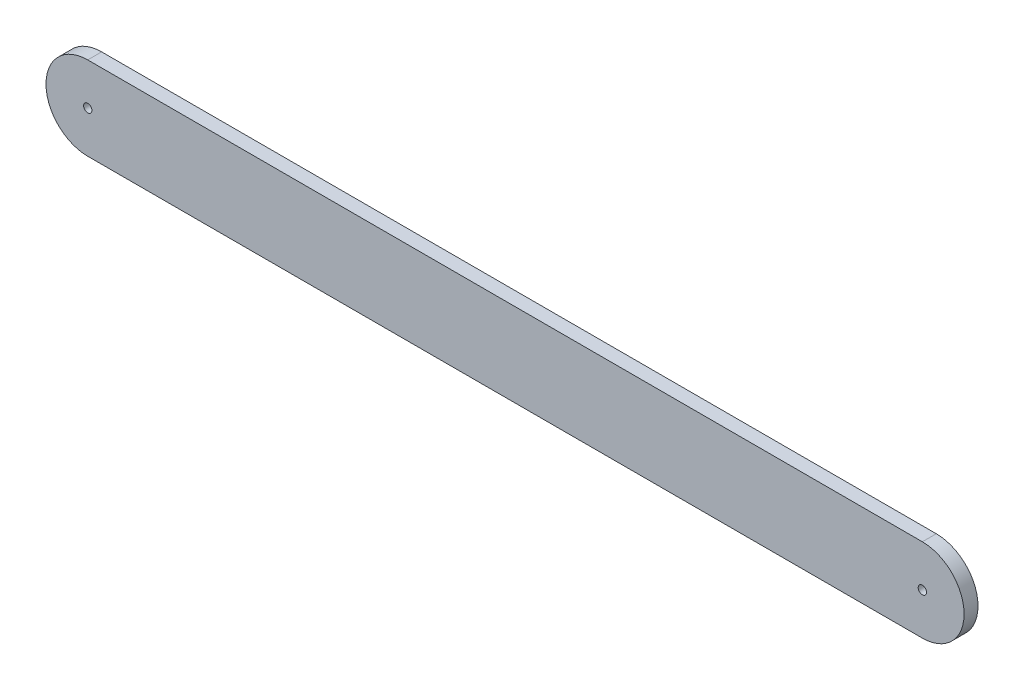
ISO-10303-21;
HEADER;
FILE_DESCRIPTION(('STEP AP214'),'2;1');
FILE_NAME('part.step','',(''),(''),'','','');
FILE_SCHEMA(('AUTOMOTIVE_DESIGN { 1 0 10303 214 1 1 1 1 }'));
ENDSEC;
DATA;
#1=APPLICATION_CONTEXT('core data for automotive mechanical design processes');
#2=APPLICATION_PROTOCOL_DEFINITION('international standard','automotive_design',2000,#1);
#3=PRODUCT_CONTEXT('',#1,'mechanical');
#4=PRODUCT('Part','Part','',(#3));
#5=PRODUCT_RELATED_PRODUCT_CATEGORY('part','',(#4));
#6=PRODUCT_DEFINITION_FORMATION('','',#4);
#7=PRODUCT_DEFINITION_CONTEXT('part definition',#1,'design');
#8=PRODUCT_DEFINITION('design','',#6,#7);
#9=PRODUCT_DEFINITION_SHAPE('','',#8);
#10=(LENGTH_UNIT() NAMED_UNIT(*) SI_UNIT(.MILLI.,.METRE.));
#11=(NAMED_UNIT(*) PLANE_ANGLE_UNIT() SI_UNIT($,.RADIAN.));
#12=(NAMED_UNIT(*) SI_UNIT($,.STERADIAN.) SOLID_ANGLE_UNIT());
#13=UNCERTAINTY_MEASURE_WITH_UNIT(LENGTH_MEASURE(1.E-05),#10,'distance_accuracy_value','');
#14=(GEOMETRIC_REPRESENTATION_CONTEXT(3) GLOBAL_UNCERTAINTY_ASSIGNED_CONTEXT((#13)) GLOBAL_UNIT_ASSIGNED_CONTEXT((#10,
#11,#12)) REPRESENTATION_CONTEXT('',''));
#15=CARTESIAN_POINT('',(0.,0.,0.));
#16=DIRECTION('',(0.,0.,1.));
#17=DIRECTION('',(1.,0.,0.));
#18=AXIS2_PLACEMENT_3D('',#15,#16,#17);
#19=CARTESIAN_POINT('',(-133.993902439024,0.,5.));
#20=DIRECTION('',(0.,0.,1.));
#21=DIRECTION('',(1.,0.,0.));
#22=AXIS2_PLACEMENT_3D('',#19,#20,#21);
#23=PLANE('',#22);
#24=CARTESIAN_POINT('',(-133.993902439024,0.,5.));
#25=DIRECTION('',(0.,0.,1.));
#26=DIRECTION('',(1.,0.,0.));
#27=AXIS2_PLACEMENT_3D('',#24,#25,#26);
#28=CIRCLE('',#27,1.5);
#29=CARTESIAN_POINT('',(-132.493902439024,0.,5.));
#30=VERTEX_POINT('',#29);
#31=EDGE_CURVE('E100',#30,#30,#28,.T.);
#32=ORIENTED_EDGE('',*,*,#31,.F.);
#33=EDGE_LOOP('',(#32));
#34=FACE_BOUND('',#33,.T.);
#35=CARTESIAN_POINT('',(-133.993902439024,0.,5.));
#36=DIRECTION('',(0.,0.,1.));
#37=DIRECTION('',(1.,0.,0.));
#38=AXIS2_PLACEMENT_3D('',#35,#36,#37);
#39=CIRCLE('',#38,15.);
#40=CARTESIAN_POINT('',(-133.993902439024,15.,5.));
#41=VERTEX_POINT('',#40);
#42=CARTESIAN_POINT('',(-133.993902439024,-15.,5.));
#43=VERTEX_POINT('',#42);
#44=EDGE_CURVE('E85',#41,#43,#39,.T.);
#45=ORIENTED_EDGE('',*,*,#44,.T.);
#46=DIRECTION('',(1.,0.,0.));
#47=VECTOR('',#46,1.);
#48=CARTESIAN_POINT('',(-133.993902439024,-15.,5.));
#49=LINE('',#48,#47);
#50=CARTESIAN_POINT('',(166.006097560976,-15.,5.));
#51=VERTEX_POINT('',#50);
#52=EDGE_CURVE('E80',#43,#51,#49,.T.);
#53=ORIENTED_EDGE('',*,*,#52,.T.);
#54=CARTESIAN_POINT('',(166.006097560976,0.,5.));
#55=DIRECTION('',(0.,0.,1.));
#56=DIRECTION('',(1.,0.,0.));
#57=AXIS2_PLACEMENT_3D('',#54,#55,#56);
#58=CIRCLE('',#57,15.);
#59=CARTESIAN_POINT('',(166.006097560976,15.,5.));
#60=VERTEX_POINT('',#59);
#61=EDGE_CURVE('E83',#51,#60,#58,.T.);
#62=ORIENTED_EDGE('',*,*,#61,.T.);
#63=DIRECTION('',(-1.,0.,0.));
#64=VECTOR('',#63,1.);
#65=CARTESIAN_POINT('',(-133.993902439024,15.,5.));
#66=LINE('',#65,#64);
#67=EDGE_CURVE('E50',#60,#41,#66,.T.);
#68=ORIENTED_EDGE('',*,*,#67,.T.);
#69=EDGE_LOOP('',(#45,#53,#62,#68));
#70=FACE_BOUND('',#69,.T.);
#71=CARTESIAN_POINT('',(166.006097560976,0.,5.));
#72=DIRECTION('',(0.,0.,1.));
#73=DIRECTION('',(1.,0.,0.));
#74=AXIS2_PLACEMENT_3D('',#71,#72,#73);
#75=CIRCLE('',#74,1.5);
#76=CARTESIAN_POINT('',(167.506097560976,0.,5.));
#77=VERTEX_POINT('',#76);
#78=EDGE_CURVE('E115',#77,#77,#75,.T.);
#79=ORIENTED_EDGE('',*,*,#78,.F.);
#80=EDGE_LOOP('',(#79));
#81=FACE_BOUND('',#80,.T.);
#82=ADVANCED_FACE('F33',(#34,#70,#81),#23,.T.);
#83=CARTESIAN_POINT('',(-133.993902439024,0.,0.));
#84=DIRECTION('',(0.,0.,1.));
#85=DIRECTION('',(1.,0.,0.));
#86=AXIS2_PLACEMENT_3D('',#83,#84,#85);
#87=PLANE('',#86);
#88=CARTESIAN_POINT('',(-133.993902439024,0.,0.));
#89=DIRECTION('',(0.,0.,1.));
#90=DIRECTION('',(1.,0.,0.));
#91=AXIS2_PLACEMENT_3D('',#88,#89,#90);
#92=CIRCLE('',#91,15.);
#93=CARTESIAN_POINT('',(-133.993902439024,15.,0.));
#94=VERTEX_POINT('',#93);
#95=CARTESIAN_POINT('',(-133.993902439024,-15.,0.));
#96=VERTEX_POINT('',#95);
#97=EDGE_CURVE('E97',#94,#96,#92,.T.);
#98=ORIENTED_EDGE('',*,*,#97,.F.);
#99=DIRECTION('',(-1.,0.,0.));
#100=VECTOR('',#99,1.);
#101=CARTESIAN_POINT('',(-133.993902439024,15.,0.));
#102=LINE('',#101,#100);
#103=CARTESIAN_POINT('',(166.006097560976,15.,0.));
#104=VERTEX_POINT('',#103);
#105=EDGE_CURVE('E73',#104,#94,#102,.T.);
#106=ORIENTED_EDGE('',*,*,#105,.F.);
#107=CARTESIAN_POINT('',(166.006097560976,0.,0.));
#108=DIRECTION('',(0.,0.,1.));
#109=DIRECTION('',(1.,0.,0.));
#110=AXIS2_PLACEMENT_3D('',#107,#108,#109);
#111=CIRCLE('',#110,15.);
#112=CARTESIAN_POINT('',(166.006097560976,-15.,0.));
#113=VERTEX_POINT('',#112);
#114=EDGE_CURVE('E67',#113,#104,#111,.T.);
#115=ORIENTED_EDGE('',*,*,#114,.F.);
#116=DIRECTION('',(1.,0.,0.));
#117=VECTOR('',#116,1.);
#118=CARTESIAN_POINT('',(-133.993902439024,-15.,0.));
#119=LINE('',#118,#117);
#120=EDGE_CURVE('E89',#96,#113,#119,.T.);
#121=ORIENTED_EDGE('',*,*,#120,.F.);
#122=EDGE_LOOP('',(#98,#106,#115,#121));
#123=FACE_BOUND('',#122,.T.);
#124=CARTESIAN_POINT('',(-133.993902439024,0.,0.));
#125=DIRECTION('',(0.,0.,1.));
#126=DIRECTION('',(1.,0.,0.));
#127=AXIS2_PLACEMENT_3D('',#124,#125,#126);
#128=CIRCLE('',#127,1.5);
#129=CARTESIAN_POINT('',(-132.493902439024,0.,0.));
#130=VERTEX_POINT('',#129);
#131=EDGE_CURVE('E112',#130,#130,#128,.T.);
#132=ORIENTED_EDGE('',*,*,#131,.T.);
#133=EDGE_LOOP('',(#132));
#134=FACE_BOUND('',#133,.T.);
#135=CARTESIAN_POINT('',(166.006097560976,0.,0.));
#136=DIRECTION('',(0.,0.,1.));
#137=DIRECTION('',(1.,0.,0.));
#138=AXIS2_PLACEMENT_3D('',#135,#136,#137);
#139=CIRCLE('',#138,1.5);
#140=CARTESIAN_POINT('',(167.506097560976,0.,0.));
#141=VERTEX_POINT('',#140);
#142=EDGE_CURVE('E118',#141,#141,#139,.T.);
#143=ORIENTED_EDGE('',*,*,#142,.T.);
#144=EDGE_LOOP('',(#143));
#145=FACE_BOUND('',#144,.T.);
#146=ADVANCED_FACE('F108',(#123,#134,#145),#87,.F.);
#147=CARTESIAN_POINT('',(-133.993902439024,0.,5.));
#148=DIRECTION('',(0.,0.,-1.));
#149=DIRECTION('',(-1.,0.,0.));
#150=AXIS2_PLACEMENT_3D('',#147,#148,#149);
#151=CYLINDRICAL_SURFACE('',#150,15.);
#152=ORIENTED_EDGE('',*,*,#97,.T.);
#153=DIRECTION('',(0.,0.,-1.));
#154=VECTOR('',#153,1.);
#155=CARTESIAN_POINT('',(-133.993902439024,-15.,5.));
#156=LINE('',#155,#154);
#157=EDGE_CURVE('E11',#43,#96,#156,.T.);
#158=ORIENTED_EDGE('',*,*,#157,.F.);
#159=ORIENTED_EDGE('',*,*,#44,.F.);
#160=DIRECTION('',(0.,0.,-1.));
#161=VECTOR('',#160,1.);
#162=CARTESIAN_POINT('',(-133.993902439024,15.,5.));
#163=LINE('',#162,#161);
#164=EDGE_CURVE('E93',#41,#94,#163,.T.);
#165=ORIENTED_EDGE('',*,*,#164,.T.);
#166=EDGE_LOOP('',(#152,#158,#159,#165));
#167=FACE_BOUND('',#166,.T.);
#168=ADVANCED_FACE('F35',(#167),#151,.T.);
#169=CARTESIAN_POINT('',(-133.993902439024,-15.,5.));
#170=DIRECTION('',(0.,1.,0.));
#171=DIRECTION('',(-1.,0.,0.));
#172=AXIS2_PLACEMENT_3D('',#169,#170,#171);
#173=PLANE('',#172);
#174=ORIENTED_EDGE('',*,*,#120,.T.);
#175=DIRECTION('',(0.,0.,-1.));
#176=VECTOR('',#175,1.);
#177=CARTESIAN_POINT('',(166.006097560976,-15.,5.));
#178=LINE('',#177,#176);
#179=EDGE_CURVE('E42',#51,#113,#178,.T.);
#180=ORIENTED_EDGE('',*,*,#179,.F.);
#181=ORIENTED_EDGE('',*,*,#52,.F.);
#182=ORIENTED_EDGE('',*,*,#157,.T.);
#183=EDGE_LOOP('',(#174,#180,#181,#182));
#184=FACE_BOUND('',#183,.T.);
#185=ADVANCED_FACE('F88',(#184),#173,.F.);
#186=CARTESIAN_POINT('',(166.006097560976,0.,5.));
#187=DIRECTION('',(0.,0.,-1.));
#188=DIRECTION('',(-1.,0.,0.));
#189=AXIS2_PLACEMENT_3D('',#186,#187,#188);
#190=CYLINDRICAL_SURFACE('',#189,15.);
#191=ORIENTED_EDGE('',*,*,#114,.T.);
#192=DIRECTION('',(0.,0.,-1.));
#193=VECTOR('',#192,1.);
#194=CARTESIAN_POINT('',(166.006097560976,15.,5.));
#195=LINE('',#194,#193);
#196=EDGE_CURVE('E90',#60,#104,#195,.T.);
#197=ORIENTED_EDGE('',*,*,#196,.F.);
#198=ORIENTED_EDGE('',*,*,#61,.F.);
#199=ORIENTED_EDGE('',*,*,#179,.T.);
#200=EDGE_LOOP('',(#191,#197,#198,#199));
#201=FACE_BOUND('',#200,.T.);
#202=ADVANCED_FACE('F91',(#201),#190,.T.);
#203=CARTESIAN_POINT('',(-133.993902439024,15.,5.));
#204=DIRECTION('',(0.,-1.,0.));
#205=DIRECTION('',(1.,0.,0.));
#206=AXIS2_PLACEMENT_3D('',#203,#204,#205);
#207=PLANE('',#206);
#208=ORIENTED_EDGE('',*,*,#105,.T.);
#209=ORIENTED_EDGE('',*,*,#164,.F.);
#210=ORIENTED_EDGE('',*,*,#67,.F.);
#211=ORIENTED_EDGE('',*,*,#196,.T.);
#212=EDGE_LOOP('',(#208,#209,#210,#211));
#213=FACE_BOUND('',#212,.T.);
#214=ADVANCED_FACE('F105',(#213),#207,.F.);
#215=CARTESIAN_POINT('',(-133.993902439024,0.,5.));
#216=DIRECTION('',(0.,0.,-1.));
#217=DIRECTION('',(-1.,0.,0.));
#218=AXIS2_PLACEMENT_3D('',#215,#216,#217);
#219=CYLINDRICAL_SURFACE('',#218,1.5);
#220=ORIENTED_EDGE('',*,*,#31,.T.);
#221=EDGE_LOOP('',(#220));
#222=FACE_BOUND('',#221,.T.);
#223=ORIENTED_EDGE('',*,*,#131,.F.);
#224=EDGE_LOOP('',(#223));
#225=FACE_BOUND('',#224,.T.);
#226=ADVANCED_FACE('F135',(#222,#225),#219,.F.);
#227=CARTESIAN_POINT('',(166.006097560976,0.,5.));
#228=DIRECTION('',(0.,0.,-1.));
#229=DIRECTION('',(-1.,0.,0.));
#230=AXIS2_PLACEMENT_3D('',#227,#228,#229);
#231=CYLINDRICAL_SURFACE('',#230,1.5);
#232=ORIENTED_EDGE('',*,*,#78,.T.);
#233=EDGE_LOOP('',(#232));
#234=FACE_BOUND('',#233,.T.);
#235=ORIENTED_EDGE('',*,*,#142,.F.);
#236=EDGE_LOOP('',(#235));
#237=FACE_BOUND('',#236,.T.);
#238=ADVANCED_FACE('F124',(#234,#237),#231,.F.);
#239=CLOSED_SHELL('',(#82,#146,#168,#185,#202,#214,#226,#238));
#240=MANIFOLD_SOLID_BREP('B2',#239);
#241=ADVANCED_BREP_SHAPE_REPRESENTATION('',(#18,#240),#14);
#242=SHAPE_DEFINITION_REPRESENTATION(#9,#241);
ENDSEC;
END-ISO-10303-21;
